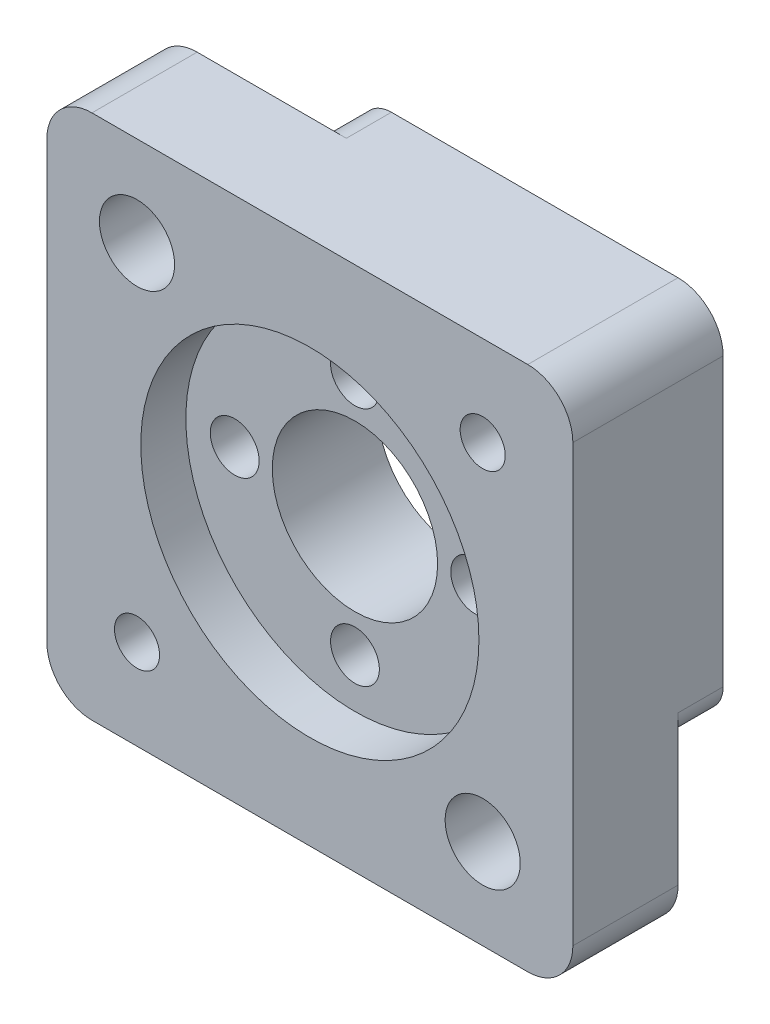
ISO-10303-21;
HEADER;
FILE_DESCRIPTION(('STEP AP214'),'2;1');
FILE_NAME('part.step','',(''),(''),'','','');
FILE_SCHEMA(('AUTOMOTIVE_DESIGN { 1 0 10303 214 1 1 1 1 }'));
ENDSEC;
DATA;
#1=APPLICATION_CONTEXT('core data for automotive mechanical design processes');
#2=APPLICATION_PROTOCOL_DEFINITION('international standard','automotive_design',2000,#1);
#3=PRODUCT_CONTEXT('',#1,'mechanical');
#4=PRODUCT('Part','Part','',(#3));
#5=PRODUCT_RELATED_PRODUCT_CATEGORY('part','',(#4));
#6=PRODUCT_DEFINITION_FORMATION('','',#4);
#7=PRODUCT_DEFINITION_CONTEXT('part definition',#1,'design');
#8=PRODUCT_DEFINITION('design','',#6,#7);
#9=PRODUCT_DEFINITION_SHAPE('','',#8);
#10=(LENGTH_UNIT() NAMED_UNIT(*) SI_UNIT(.MILLI.,.METRE.));
#11=(NAMED_UNIT(*) PLANE_ANGLE_UNIT() SI_UNIT($,.RADIAN.));
#12=(NAMED_UNIT(*) SI_UNIT($,.STERADIAN.) SOLID_ANGLE_UNIT());
#13=UNCERTAINTY_MEASURE_WITH_UNIT(LENGTH_MEASURE(1.E-05),#10,'distance_accuracy_value','');
#14=(GEOMETRIC_REPRESENTATION_CONTEXT(3) GLOBAL_UNCERTAINTY_ASSIGNED_CONTEXT((#13)) GLOBAL_UNIT_ASSIGNED_CONTEXT((#10,
#11,#12)) REPRESENTATION_CONTEXT('',''));
#15=CARTESIAN_POINT('',(0.,0.,0.));
#16=DIRECTION('',(0.,0.,1.));
#17=DIRECTION('',(1.,0.,0.));
#18=AXIS2_PLACEMENT_3D('',#15,#16,#17);
#19=CARTESIAN_POINT('',(0.,0.,0.));
#20=DIRECTION('',(0.,0.,-1.));
#21=DIRECTION('',(-1.,0.,0.));
#22=AXIS2_PLACEMENT_3D('',#19,#20,#21);
#23=PLANE('',#22);
#24=CARTESIAN_POINT('',(-11.5,11.5,0.));
#25=DIRECTION('',(0.,0.,-1.));
#26=DIRECTION('',(-1.,0.,0.));
#27=AXIS2_PLACEMENT_3D('',#24,#25,#26);
#28=CIRCLE('',#27,6.);
#29=CARTESIAN_POINT('',(-6.30384757729338,14.5,0.));
#30=VERTEX_POINT('',#29);
#31=CARTESIAN_POINT('',(-14.5,6.30384757729337,0.));
#32=VERTEX_POINT('',#31);
#33=EDGE_CURVE('E362',#30,#32,#28,.T.);
#34=ORIENTED_EDGE('',*,*,#33,.F.);
#35=CARTESIAN_POINT('',(-4.5717967697245,15.5,0.));
#36=DIRECTION('',(0.,0.,-1.));
#37=DIRECTION('',(-1.,0.,0.));
#38=AXIS2_PLACEMENT_3D('',#35,#36,#37);
#39=CIRCLE('',#38,2.);
#40=CARTESIAN_POINT('',(-4.5717967697245,17.5,0.));
#41=VERTEX_POINT('',#40);
#42=EDGE_CURVE('E229',#30,#41,#39,.T.);
#43=ORIENTED_EDGE('',*,*,#42,.T.);
#44=DIRECTION('',(-1.,0.,0.));
#45=VECTOR('',#44,1.);
#46=CARTESIAN_POINT('',(-17.5,17.5,0.));
#47=LINE('',#46,#45);
#48=CARTESIAN_POINT('',(14.5,17.5,0.));
#49=VERTEX_POINT('',#48);
#50=EDGE_CURVE('E291',#49,#41,#47,.T.);
#51=ORIENTED_EDGE('',*,*,#50,.F.);
#52=CARTESIAN_POINT('',(14.5,14.5,0.));
#53=DIRECTION('',(0.,0.,-1.));
#54=DIRECTION('',(-1.,0.,0.));
#55=AXIS2_PLACEMENT_3D('',#52,#53,#54);
#56=CIRCLE('',#55,3.);
#57=CARTESIAN_POINT('',(17.5,14.5,0.));
#58=VERTEX_POINT('',#57);
#59=EDGE_CURVE('E182',#49,#58,#56,.T.);
#60=ORIENTED_EDGE('',*,*,#59,.T.);
#61=DIRECTION('',(0.,1.,0.));
#62=VECTOR('',#61,1.);
#63=CARTESIAN_POINT('',(17.5,-17.5,0.));
#64=LINE('',#63,#62);
#65=CARTESIAN_POINT('',(17.5,-4.57179676972449,0.));
#66=VERTEX_POINT('',#65);
#67=EDGE_CURVE('E309',#66,#58,#64,.T.);
#68=ORIENTED_EDGE('',*,*,#67,.F.);
#69=CARTESIAN_POINT('',(15.5,-4.57179676972449,0.));
#70=DIRECTION('',(0.,0.,-1.));
#71=DIRECTION('',(-1.,0.,0.));
#72=AXIS2_PLACEMENT_3D('',#69,#70,#71);
#73=CIRCLE('',#72,2.);
#74=CARTESIAN_POINT('',(14.5,-6.30384757729337,0.));
#75=VERTEX_POINT('',#74);
#76=EDGE_CURVE('E220',#66,#75,#73,.T.);
#77=ORIENTED_EDGE('',*,*,#76,.T.);
#78=CARTESIAN_POINT('',(11.5,-11.5,0.));
#79=DIRECTION('',(0.,0.,-1.));
#80=DIRECTION('',(-1.,0.,0.));
#81=AXIS2_PLACEMENT_3D('',#78,#79,#80);
#82=CIRCLE('',#81,6.);
#83=CARTESIAN_POINT('',(6.30384757729338,-14.5,0.));
#84=VERTEX_POINT('',#83);
#85=EDGE_CURVE('E280',#84,#75,#82,.T.);
#86=ORIENTED_EDGE('',*,*,#85,.F.);
#87=CARTESIAN_POINT('',(4.5717967697245,-15.5,0.));
#88=DIRECTION('',(0.,0.,-1.));
#89=DIRECTION('',(-1.,0.,0.));
#90=AXIS2_PLACEMENT_3D('',#87,#88,#89);
#91=CIRCLE('',#90,2.);
#92=CARTESIAN_POINT('',(4.5717967697245,-17.5,0.));
#93=VERTEX_POINT('',#92);
#94=EDGE_CURVE('E223',#84,#93,#91,.T.);
#95=ORIENTED_EDGE('',*,*,#94,.T.);
#96=DIRECTION('',(1.,0.,0.));
#97=VECTOR('',#96,1.);
#98=CARTESIAN_POINT('',(-17.5,-17.5,0.));
#99=LINE('',#98,#97);
#100=CARTESIAN_POINT('',(-14.5,-17.5,0.));
#101=VERTEX_POINT('',#100);
#102=EDGE_CURVE('E279',#101,#93,#99,.T.);
#103=ORIENTED_EDGE('',*,*,#102,.F.);
#104=CARTESIAN_POINT('',(-14.5,-14.5,0.));
#105=DIRECTION('',(0.,0.,-1.));
#106=DIRECTION('',(-1.,0.,0.));
#107=AXIS2_PLACEMENT_3D('',#104,#105,#106);
#108=CIRCLE('',#107,3.);
#109=CARTESIAN_POINT('',(-17.5,-14.5,0.));
#110=VERTEX_POINT('',#109);
#111=EDGE_CURVE('E302',#101,#110,#108,.T.);
#112=ORIENTED_EDGE('',*,*,#111,.T.);
#113=DIRECTION('',(0.,-1.,0.));
#114=VECTOR('',#113,1.);
#115=CARTESIAN_POINT('',(-17.5,-17.5,0.));
#116=LINE('',#115,#114);
#117=CARTESIAN_POINT('',(-17.5,4.57179676972449,0.));
#118=VERTEX_POINT('',#117);
#119=EDGE_CURVE('E284',#118,#110,#116,.T.);
#120=ORIENTED_EDGE('',*,*,#119,.F.);
#121=CARTESIAN_POINT('',(-15.5,4.57179676972449,0.));
#122=DIRECTION('',(0.,0.,-1.));
#123=DIRECTION('',(-1.,0.,0.));
#124=AXIS2_PLACEMENT_3D('',#121,#122,#123);
#125=CIRCLE('',#124,2.);
#126=EDGE_CURVE('E226',#118,#32,#125,.T.);
#127=ORIENTED_EDGE('',*,*,#126,.T.);
#128=EDGE_LOOP('',(#34,#43,#51,#60,#68,#77,#86,#95,#103,#112,#120,#127));
#129=FACE_BOUND('',#128,.T.);
#130=CARTESIAN_POINT('',(-11.5,-11.5,0.));
#131=DIRECTION('',(0.,0.,1.));
#132=DIRECTION('',(1.,0.,0.));
#133=AXIS2_PLACEMENT_3D('',#130,#131,#132);
#134=CIRCLE('',#133,1.5);
#135=CARTESIAN_POINT('',(-10.,-11.5,0.));
#136=VERTEX_POINT('',#135);
#137=EDGE_CURVE('E398',#136,#136,#134,.T.);
#138=ORIENTED_EDGE('',*,*,#137,.T.);
#139=EDGE_LOOP('',(#138));
#140=FACE_BOUND('',#139,.T.);
#141=CARTESIAN_POINT('',(11.5,11.5,0.));
#142=DIRECTION('',(0.,0.,1.));
#143=DIRECTION('',(1.,0.,0.));
#144=AXIS2_PLACEMENT_3D('',#141,#142,#143);
#145=CIRCLE('',#144,1.5);
#146=CARTESIAN_POINT('',(13.,11.5,0.));
#147=VERTEX_POINT('',#146);
#148=EDGE_CURVE('E421',#147,#147,#145,.T.);
#149=ORIENTED_EDGE('',*,*,#148,.T.);
#150=EDGE_LOOP('',(#149));
#151=FACE_BOUND('',#150,.T.);
#152=CARTESIAN_POINT('',(0.,0.,0.));
#153=DIRECTION('',(0.,0.,1.));
#154=DIRECTION('',(1.,0.,0.));
#155=AXIS2_PLACEMENT_3D('',#152,#153,#154);
#156=CIRCLE('',#155,5.5);
#157=CARTESIAN_POINT('',(5.5,0.,0.));
#158=VERTEX_POINT('',#157);
#159=EDGE_CURVE('E332',#158,#158,#156,.T.);
#160=ORIENTED_EDGE('',*,*,#159,.T.);
#161=EDGE_LOOP('',(#160));
#162=FACE_BOUND('',#161,.T.);
#163=CARTESIAN_POINT('',(0.,-8.,0.));
#164=DIRECTION('',(0.,0.,1.));
#165=DIRECTION('',(1.,0.,0.));
#166=AXIS2_PLACEMENT_3D('',#163,#164,#165);
#167=CIRCLE('',#166,1.625);
#168=CARTESIAN_POINT('',(1.625,-8.,0.));
#169=VERTEX_POINT('',#168);
#170=EDGE_CURVE('E393',#169,#169,#167,.T.);
#171=ORIENTED_EDGE('',*,*,#170,.T.);
#172=EDGE_LOOP('',(#171));
#173=FACE_BOUND('',#172,.T.);
#174=CARTESIAN_POINT('',(8.,0.,0.));
#175=DIRECTION('',(0.,0.,1.));
#176=DIRECTION('',(1.,0.,0.));
#177=AXIS2_PLACEMENT_3D('',#174,#175,#176);
#178=CIRCLE('',#177,1.625);
#179=CARTESIAN_POINT('',(9.625,0.,0.));
#180=VERTEX_POINT('',#179);
#181=EDGE_CURVE('E403',#180,#180,#178,.T.);
#182=ORIENTED_EDGE('',*,*,#181,.T.);
#183=EDGE_LOOP('',(#182));
#184=FACE_BOUND('',#183,.T.);
#185=CARTESIAN_POINT('',(0.,8.,0.));
#186=DIRECTION('',(0.,0.,1.));
#187=DIRECTION('',(1.,0.,0.));
#188=AXIS2_PLACEMENT_3D('',#185,#186,#187);
#189=CIRCLE('',#188,1.625);
#190=CARTESIAN_POINT('',(1.625,8.,0.));
#191=VERTEX_POINT('',#190);
#192=EDGE_CURVE('E399',#191,#191,#189,.T.);
#193=ORIENTED_EDGE('',*,*,#192,.T.);
#194=EDGE_LOOP('',(#193));
#195=FACE_BOUND('',#194,.T.);
#196=CARTESIAN_POINT('',(-8.,0.,0.));
#197=DIRECTION('',(0.,0.,1.));
#198=DIRECTION('',(1.,0.,0.));
#199=AXIS2_PLACEMENT_3D('',#196,#197,#198);
#200=CIRCLE('',#199,1.625);
#201=CARTESIAN_POINT('',(-6.375,0.,0.));
#202=VERTEX_POINT('',#201);
#203=EDGE_CURVE('E394',#202,#202,#200,.T.);
#204=ORIENTED_EDGE('',*,*,#203,.T.);
#205=EDGE_LOOP('',(#204));
#206=FACE_BOUND('',#205,.T.);
#207=ADVANCED_FACE('F39',(#129,#140,#151,#162,#173,#184,#195,#206),#23,.T.);
#208=CARTESIAN_POINT('',(-17.5,17.5,10.));
#209=DIRECTION('',(0.,-1.,0.));
#210=DIRECTION('',(0.,0.,-1.));
#211=AXIS2_PLACEMENT_3D('',#208,#209,#210);
#212=PLANE('',#211);
#213=ORIENTED_EDGE('',*,*,#50,.T.);
#214=DIRECTION('',(0.,0.,-1.));
#215=VECTOR('',#214,1.);
#216=CARTESIAN_POINT('',(-4.5717967697245,17.5,10.));
#217=LINE('',#216,#215);
#218=CARTESIAN_POINT('',(-4.5717967697245,17.5,3.));
#219=VERTEX_POINT('',#218);
#220=EDGE_CURVE('E232',#41,#219,#217,.F.);
#221=ORIENTED_EDGE('',*,*,#220,.T.);
#222=DIRECTION('',(1.,0.,0.));
#223=VECTOR('',#222,1.);
#224=CARTESIAN_POINT('',(0.,17.5,3.));
#225=LINE('',#224,#223);
#226=CARTESIAN_POINT('',(-14.5,17.5,3.));
#227=VERTEX_POINT('',#226);
#228=EDGE_CURVE('E348',#227,#219,#225,.T.);
#229=ORIENTED_EDGE('',*,*,#228,.F.);
#230=DIRECTION('',(0.,0.,-1.));
#231=VECTOR('',#230,1.);
#232=CARTESIAN_POINT('',(-14.5,17.5,10.));
#233=LINE('',#232,#231);
#234=CARTESIAN_POINT('',(-14.5,17.5,10.));
#235=VERTEX_POINT('',#234);
#236=EDGE_CURVE('E193',#227,#235,#233,.F.);
#237=ORIENTED_EDGE('',*,*,#236,.T.);
#238=DIRECTION('',(-1.,0.,0.));
#239=VECTOR('',#238,1.);
#240=CARTESIAN_POINT('',(-17.5,17.5,10.));
#241=LINE('',#240,#239);
#242=CARTESIAN_POINT('',(14.5,17.5,10.));
#243=VERTEX_POINT('',#242);
#244=EDGE_CURVE('E289',#243,#235,#241,.T.);
#245=ORIENTED_EDGE('',*,*,#244,.F.);
#246=DIRECTION('',(0.,0.,-1.));
#247=VECTOR('',#246,1.);
#248=CARTESIAN_POINT('',(14.5,17.5,10.));
#249=LINE('',#248,#247);
#250=EDGE_CURVE('E196',#243,#49,#249,.T.);
#251=ORIENTED_EDGE('',*,*,#250,.T.);
#252=EDGE_LOOP('',(#213,#221,#229,#237,#245,#251));
#253=FACE_BOUND('',#252,.T.);
#254=ADVANCED_FACE('F336',(#253),#212,.F.);
#255=CARTESIAN_POINT('',(-17.5,-17.5,10.));
#256=DIRECTION('',(1.,0.,0.));
#257=DIRECTION('',(0.,0.,-1.));
#258=AXIS2_PLACEMENT_3D('',#255,#256,#257);
#259=PLANE('',#258);
#260=DIRECTION('',(0.,1.,0.));
#261=VECTOR('',#260,1.);
#262=CARTESIAN_POINT('',(-17.5,0.,3.));
#263=LINE('',#262,#261);
#264=CARTESIAN_POINT('',(-17.5,4.57179676972449,3.));
#265=VERTEX_POINT('',#264);
#266=CARTESIAN_POINT('',(-17.5,14.5,3.));
#267=VERTEX_POINT('',#266);
#268=EDGE_CURVE('E354',#265,#267,#263,.T.);
#269=ORIENTED_EDGE('',*,*,#268,.F.);
#270=DIRECTION('',(0.,0.,-1.));
#271=VECTOR('',#270,1.);
#272=CARTESIAN_POINT('',(-17.5,4.57179676972449,10.));
#273=LINE('',#272,#271);
#274=EDGE_CURVE('E236',#265,#118,#273,.T.);
#275=ORIENTED_EDGE('',*,*,#274,.T.);
#276=ORIENTED_EDGE('',*,*,#119,.T.);
#277=DIRECTION('',(0.,0.,-1.));
#278=VECTOR('',#277,1.);
#279=CARTESIAN_POINT('',(-17.5,-14.5,10.));
#280=LINE('',#279,#278);
#281=CARTESIAN_POINT('',(-17.5,-14.5,10.));
#282=VERTEX_POINT('',#281);
#283=EDGE_CURVE('E204',#110,#282,#280,.F.);
#284=ORIENTED_EDGE('',*,*,#283,.T.);
#285=DIRECTION('',(0.,-1.,0.));
#286=VECTOR('',#285,1.);
#287=CARTESIAN_POINT('',(-17.5,-17.5,10.));
#288=LINE('',#287,#286);
#289=CARTESIAN_POINT('',(-17.5,14.5,10.));
#290=VERTEX_POINT('',#289);
#291=EDGE_CURVE('E325',#290,#282,#288,.T.);
#292=ORIENTED_EDGE('',*,*,#291,.F.);
#293=DIRECTION('',(0.,0.,-1.));
#294=VECTOR('',#293,1.);
#295=CARTESIAN_POINT('',(-17.5,14.5,10.));
#296=LINE('',#295,#294);
#297=EDGE_CURVE('E200',#290,#267,#296,.T.);
#298=ORIENTED_EDGE('',*,*,#297,.T.);
#299=EDGE_LOOP('',(#269,#275,#276,#284,#292,#298));
#300=FACE_BOUND('',#299,.T.);
#301=ADVANCED_FACE('F444',(#300),#259,.F.);
#302=CARTESIAN_POINT('',(-11.5,11.5,10.));
#303=DIRECTION('',(0.,0.,-1.));
#304=DIRECTION('',(-1.,0.,0.));
#305=AXIS2_PLACEMENT_3D('',#302,#303,#304);
#306=CYLINDRICAL_SURFACE('',#305,2.5);
#307=CARTESIAN_POINT('',(-11.5,11.5,10.));
#308=DIRECTION('',(0.,0.,1.));
#309=DIRECTION('',(1.,0.,0.));
#310=AXIS2_PLACEMENT_3D('',#307,#308,#309);
#311=CIRCLE('',#310,2.5);
#312=CARTESIAN_POINT('',(-9.00000000000001,11.5,10.));
#313=VERTEX_POINT('',#312);
#314=EDGE_CURVE('E426',#313,#313,#311,.T.);
#315=ORIENTED_EDGE('',*,*,#314,.T.);
#316=EDGE_LOOP('',(#315));
#317=FACE_BOUND('',#316,.T.);
#318=CARTESIAN_POINT('',(-11.5,11.5,3.));
#319=DIRECTION('',(0.,0.,-1.));
#320=DIRECTION('',(-1.,0.,0.));
#321=AXIS2_PLACEMENT_3D('',#318,#319,#320);
#322=CIRCLE('',#321,2.5);
#323=CARTESIAN_POINT('',(-14.,11.5,3.));
#324=VERTEX_POINT('',#323);
#325=EDGE_CURVE('E355',#324,#324,#322,.F.);
#326=ORIENTED_EDGE('',*,*,#325,.F.);
#327=EDGE_LOOP('',(#326));
#328=FACE_BOUND('',#327,.T.);
#329=ADVANCED_FACE('F472',(#317,#328),#306,.F.);
#330=CARTESIAN_POINT('',(11.5,-11.5,10.));
#331=DIRECTION('',(0.,0.,-1.));
#332=DIRECTION('',(-1.,0.,0.));
#333=AXIS2_PLACEMENT_3D('',#330,#331,#332);
#334=CYLINDRICAL_SURFACE('',#333,2.5);
#335=CARTESIAN_POINT('',(11.5,-11.5,10.));
#336=DIRECTION('',(0.,0.,1.));
#337=DIRECTION('',(1.,0.,0.));
#338=AXIS2_PLACEMENT_3D('',#335,#336,#337);
#339=CIRCLE('',#338,2.5);
#340=CARTESIAN_POINT('',(14.,-11.5,10.));
#341=VERTEX_POINT('',#340);
#342=EDGE_CURVE('E414',#341,#341,#339,.T.);
#343=ORIENTED_EDGE('',*,*,#342,.T.);
#344=EDGE_LOOP('',(#343));
#345=FACE_BOUND('',#344,.T.);
#346=CARTESIAN_POINT('',(11.5,-11.5,3.));
#347=DIRECTION('',(0.,0.,-1.));
#348=DIRECTION('',(-1.,0.,0.));
#349=AXIS2_PLACEMENT_3D('',#346,#347,#348);
#350=CIRCLE('',#349,2.5);
#351=CARTESIAN_POINT('',(9.00000000000002,-11.5,3.));
#352=VERTEX_POINT('',#351);
#353=EDGE_CURVE('E271',#352,#352,#350,.F.);
#354=ORIENTED_EDGE('',*,*,#353,.F.);
#355=EDGE_LOOP('',(#354));
#356=FACE_BOUND('',#355,.T.);
#357=ADVANCED_FACE('F478',(#345,#356),#334,.F.);
#358=CARTESIAN_POINT('',(14.5,-14.5,10.));
#359=DIRECTION('',(0.,0.,-1.));
#360=DIRECTION('',(-1.,0.,0.));
#361=AXIS2_PLACEMENT_3D('',#358,#359,#360);
#362=CYLINDRICAL_SURFACE('',#361,3.);
#363=DIRECTION('',(0.,0.,-1.));
#364=VECTOR('',#363,1.);
#365=CARTESIAN_POINT('',(14.5,-17.5,10.));
#366=LINE('',#365,#364);
#367=CARTESIAN_POINT('',(14.5,-17.5,3.));
#368=VERTEX_POINT('',#367);
#369=CARTESIAN_POINT('',(14.5,-17.5,10.));
#370=VERTEX_POINT('',#369);
#371=EDGE_CURVE('E162',#368,#370,#366,.F.);
#372=ORIENTED_EDGE('',*,*,#371,.F.);
#373=CARTESIAN_POINT('',(14.5,-14.5,3.));
#374=DIRECTION('',(0.,0.,-1.));
#375=DIRECTION('',(-1.,0.,0.));
#376=AXIS2_PLACEMENT_3D('',#373,#374,#375);
#377=CIRCLE('',#376,3.);
#378=CARTESIAN_POINT('',(17.5,-14.5,3.));
#379=VERTEX_POINT('',#378);
#380=EDGE_CURVE('E151',#379,#368,#377,.T.);
#381=ORIENTED_EDGE('',*,*,#380,.F.);
#382=DIRECTION('',(0.,0.,-1.));
#383=VECTOR('',#382,1.);
#384=CARTESIAN_POINT('',(17.5,-14.5,10.));
#385=LINE('',#384,#383);
#386=CARTESIAN_POINT('',(17.5,-14.5,10.));
#387=VERTEX_POINT('',#386);
#388=EDGE_CURVE('E298',#387,#379,#385,.T.);
#389=ORIENTED_EDGE('',*,*,#388,.F.);
#390=CARTESIAN_POINT('',(14.5,-14.5,10.));
#391=DIRECTION('',(0.,0.,-1.));
#392=DIRECTION('',(-1.,0.,0.));
#393=AXIS2_PLACEMENT_3D('',#390,#391,#392);
#394=CIRCLE('',#393,3.);
#395=EDGE_CURVE('E172',#370,#387,#394,.F.);
#396=ORIENTED_EDGE('',*,*,#395,.F.);
#397=EDGE_LOOP('',(#372,#381,#389,#396));
#398=FACE_BOUND('',#397,.T.);
#399=ADVANCED_FACE('F171',(#398),#362,.T.);
#400=CARTESIAN_POINT('',(-14.5,14.5,10.));
#401=DIRECTION('',(0.,0.,-1.));
#402=DIRECTION('',(-1.,0.,0.));
#403=AXIS2_PLACEMENT_3D('',#400,#401,#402);
#404=CYLINDRICAL_SURFACE('',#403,3.);
#405=ORIENTED_EDGE('',*,*,#236,.F.);
#406=CARTESIAN_POINT('',(-14.5,14.5,3.));
#407=DIRECTION('',(0.,0.,-1.));
#408=DIRECTION('',(-1.,0.,0.));
#409=AXIS2_PLACEMENT_3D('',#406,#407,#408);
#410=CIRCLE('',#409,3.);
#411=EDGE_CURVE('E359',#267,#227,#410,.T.);
#412=ORIENTED_EDGE('',*,*,#411,.F.);
#413=ORIENTED_EDGE('',*,*,#297,.F.);
#414=CARTESIAN_POINT('',(-14.5,14.5,10.));
#415=DIRECTION('',(0.,0.,-1.));
#416=DIRECTION('',(-1.,0.,0.));
#417=AXIS2_PLACEMENT_3D('',#414,#415,#416);
#418=CIRCLE('',#417,3.);
#419=EDGE_CURVE('E174',#235,#290,#418,.F.);
#420=ORIENTED_EDGE('',*,*,#419,.F.);
#421=EDGE_LOOP('',(#405,#412,#413,#420));
#422=FACE_BOUND('',#421,.T.);
#423=ADVANCED_FACE('F441',(#422),#404,.T.);
#424=CARTESIAN_POINT('',(0.,0.,10.));
#425=DIRECTION('',(0.,0.,-1.));
#426=DIRECTION('',(-1.,0.,0.));
#427=AXIS2_PLACEMENT_3D('',#424,#425,#426);
#428=CYLINDRICAL_SURFACE('',#427,5.5);
#429=ORIENTED_EDGE('',*,*,#159,.F.);
#430=EDGE_LOOP('',(#429));
#431=FACE_BOUND('',#430,.T.);
#432=CARTESIAN_POINT('',(0.,0.,7.));
#433=DIRECTION('',(0.,0.,1.));
#434=DIRECTION('',(1.,0.,0.));
#435=AXIS2_PLACEMENT_3D('',#432,#433,#434);
#436=CIRCLE('',#435,5.5);
#437=CARTESIAN_POINT('',(5.5,0.,7.));
#438=VERTEX_POINT('',#437);
#439=EDGE_CURVE('E389',#438,#438,#436,.T.);
#440=ORIENTED_EDGE('',*,*,#439,.T.);
#441=EDGE_LOOP('',(#440));
#442=FACE_BOUND('',#441,.T.);
#443=ADVANCED_FACE('F486',(#431,#442),#428,.F.);
#444=CARTESIAN_POINT('',(0.,-8.,0.));
#445=DIRECTION('',(0.,0.,1.));
#446=DIRECTION('',(1.,0.,0.));
#447=AXIS2_PLACEMENT_3D('',#444,#445,#446);
#448=CYLINDRICAL_SURFACE('',#447,1.625);
#449=ORIENTED_EDGE('',*,*,#170,.F.);
#450=EDGE_LOOP('',(#449));
#451=FACE_BOUND('',#450,.T.);
#452=CARTESIAN_POINT('',(0.,-8.,7.));
#453=DIRECTION('',(0.,0.,1.));
#454=DIRECTION('',(1.,0.,0.));
#455=AXIS2_PLACEMENT_3D('',#452,#453,#454);
#456=CIRCLE('',#455,1.625);
#457=CARTESIAN_POINT('',(1.625,-8.,7.));
#458=VERTEX_POINT('',#457);
#459=EDGE_CURVE('E385',#458,#458,#456,.F.);
#460=ORIENTED_EDGE('',*,*,#459,.F.);
#461=EDGE_LOOP('',(#460));
#462=FACE_BOUND('',#461,.T.);
#463=ADVANCED_FACE('F490',(#451,#462),#448,.F.);
#464=CARTESIAN_POINT('',(8.,0.,0.));
#465=DIRECTION('',(0.,0.,1.));
#466=DIRECTION('',(1.,0.,0.));
#467=AXIS2_PLACEMENT_3D('',#464,#465,#466);
#468=CYLINDRICAL_SURFACE('',#467,1.625);
#469=ORIENTED_EDGE('',*,*,#181,.F.);
#470=EDGE_LOOP('',(#469));
#471=FACE_BOUND('',#470,.T.);
#472=CARTESIAN_POINT('',(8.,0.,7.));
#473=DIRECTION('',(0.,0.,1.));
#474=DIRECTION('',(1.,0.,0.));
#475=AXIS2_PLACEMENT_3D('',#472,#473,#474);
#476=CIRCLE('',#475,1.625);
#477=CARTESIAN_POINT('',(9.625,0.,7.));
#478=VERTEX_POINT('',#477);
#479=EDGE_CURVE('E381',#478,#478,#476,.F.);
#480=ORIENTED_EDGE('',*,*,#479,.F.);
#481=EDGE_LOOP('',(#480));
#482=FACE_BOUND('',#481,.T.);
#483=ADVANCED_FACE('F495',(#471,#482),#468,.F.);
#484=CARTESIAN_POINT('',(0.,8.,0.));
#485=DIRECTION('',(0.,0.,1.));
#486=DIRECTION('',(1.,0.,0.));
#487=AXIS2_PLACEMENT_3D('',#484,#485,#486);
#488=CYLINDRICAL_SURFACE('',#487,1.625);
#489=ORIENTED_EDGE('',*,*,#192,.F.);
#490=EDGE_LOOP('',(#489));
#491=FACE_BOUND('',#490,.T.);
#492=CARTESIAN_POINT('',(0.,8.,7.));
#493=DIRECTION('',(0.,0.,1.));
#494=DIRECTION('',(1.,0.,0.));
#495=AXIS2_PLACEMENT_3D('',#492,#493,#494);
#496=CIRCLE('',#495,1.625);
#497=CARTESIAN_POINT('',(1.625,8.,7.));
#498=VERTEX_POINT('',#497);
#499=EDGE_CURVE('E212',#498,#498,#496,.F.);
#500=ORIENTED_EDGE('',*,*,#499,.F.);
#501=EDGE_LOOP('',(#500));
#502=FACE_BOUND('',#501,.T.);
#503=ADVANCED_FACE('F515',(#491,#502),#488,.F.);
#504=CARTESIAN_POINT('',(-8.,0.,0.));
#505=DIRECTION('',(0.,0.,1.));
#506=DIRECTION('',(1.,0.,0.));
#507=AXIS2_PLACEMENT_3D('',#504,#505,#506);
#508=CYLINDRICAL_SURFACE('',#507,1.625);
#509=ORIENTED_EDGE('',*,*,#203,.F.);
#510=EDGE_LOOP('',(#509));
#511=FACE_BOUND('',#510,.T.);
#512=CARTESIAN_POINT('',(-8.,0.,7.));
#513=DIRECTION('',(0.,0.,1.));
#514=DIRECTION('',(1.,0.,0.));
#515=AXIS2_PLACEMENT_3D('',#512,#513,#514);
#516=CIRCLE('',#515,1.625);
#517=CARTESIAN_POINT('',(-6.375,0.,7.));
#518=VERTEX_POINT('',#517);
#519=EDGE_CURVE('E208',#518,#518,#516,.F.);
#520=ORIENTED_EDGE('',*,*,#519,.F.);
#521=EDGE_LOOP('',(#520));
#522=FACE_BOUND('',#521,.T.);
#523=ADVANCED_FACE('F519',(#511,#522),#508,.F.);
#524=CARTESIAN_POINT('',(0.,0.,10.));
#525=DIRECTION('',(0.,0.,-1.));
#526=DIRECTION('',(-1.,0.,0.));
#527=AXIS2_PLACEMENT_3D('',#524,#525,#526);
#528=PLANE('',#527);
#529=CARTESIAN_POINT('',(0.,0.,10.));
#530=DIRECTION('',(0.,0.,1.));
#531=DIRECTION('',(1.,0.,0.));
#532=AXIS2_PLACEMENT_3D('',#529,#530,#531);
#533=CIRCLE('',#532,11.25);
#534=CARTESIAN_POINT('',(11.25,0.,10.));
#535=VERTEX_POINT('',#534);
#536=EDGE_CURVE('E168',#535,#535,#533,.T.);
#537=ORIENTED_EDGE('',*,*,#536,.F.);
#538=EDGE_LOOP('',(#537));
#539=FACE_BOUND('',#538,.T.);
#540=DIRECTION('',(1.,0.,0.));
#541=VECTOR('',#540,1.);
#542=CARTESIAN_POINT('',(-17.5,-17.5,10.));
#543=LINE('',#542,#541);
#544=CARTESIAN_POINT('',(-14.5,-17.5,10.));
#545=VERTEX_POINT('',#544);
#546=EDGE_CURVE('E299',#545,#370,#543,.T.);
#547=ORIENTED_EDGE('',*,*,#546,.T.);
#548=ORIENTED_EDGE('',*,*,#395,.T.);
#549=DIRECTION('',(0.,1.,0.));
#550=VECTOR('',#549,1.);
#551=CARTESIAN_POINT('',(17.5,-17.5,10.));
#552=LINE('',#551,#550);
#553=CARTESIAN_POINT('',(17.5,14.5,10.));
#554=VERTEX_POINT('',#553);
#555=EDGE_CURVE('E283',#387,#554,#552,.T.);
#556=ORIENTED_EDGE('',*,*,#555,.T.);
#557=CARTESIAN_POINT('',(14.5,14.5,10.));
#558=DIRECTION('',(0.,0.,-1.));
#559=DIRECTION('',(-1.,0.,0.));
#560=AXIS2_PLACEMENT_3D('',#557,#558,#559);
#561=CIRCLE('',#560,3.);
#562=EDGE_CURVE('E188',#554,#243,#561,.F.);
#563=ORIENTED_EDGE('',*,*,#562,.T.);
#564=ORIENTED_EDGE('',*,*,#244,.T.);
#565=ORIENTED_EDGE('',*,*,#419,.T.);
#566=ORIENTED_EDGE('',*,*,#291,.T.);
#567=CARTESIAN_POINT('',(-14.5,-14.5,10.));
#568=DIRECTION('',(0.,0.,-1.));
#569=DIRECTION('',(-1.,0.,0.));
#570=AXIS2_PLACEMENT_3D('',#567,#568,#569);
#571=CIRCLE('',#570,3.);
#572=EDGE_CURVE('E179',#282,#545,#571,.F.);
#573=ORIENTED_EDGE('',*,*,#572,.T.);
#574=EDGE_LOOP('',(#547,#548,#556,#563,#564,#565,#566,#573));
#575=FACE_BOUND('',#574,.T.);
#576=ORIENTED_EDGE('',*,*,#314,.F.);
#577=EDGE_LOOP('',(#576));
#578=FACE_BOUND('',#577,.T.);
#579=CARTESIAN_POINT('',(11.5,11.5,10.));
#580=DIRECTION('',(0.,0.,1.));
#581=DIRECTION('',(1.,0.,0.));
#582=AXIS2_PLACEMENT_3D('',#579,#580,#581);
#583=CIRCLE('',#582,1.5);
#584=CARTESIAN_POINT('',(13.,11.5,10.));
#585=VERTEX_POINT('',#584);
#586=EDGE_CURVE('E422',#585,#585,#583,.T.);
#587=ORIENTED_EDGE('',*,*,#586,.F.);
#588=EDGE_LOOP('',(#587));
#589=FACE_BOUND('',#588,.T.);
#590=ORIENTED_EDGE('',*,*,#342,.F.);
#591=EDGE_LOOP('',(#590));
#592=FACE_BOUND('',#591,.T.);
#593=CARTESIAN_POINT('',(-11.5,-11.5,10.));
#594=DIRECTION('',(0.,0.,1.));
#595=DIRECTION('',(1.,0.,0.));
#596=AXIS2_PLACEMENT_3D('',#593,#594,#595);
#597=CIRCLE('',#596,1.5);
#598=CARTESIAN_POINT('',(-10.,-11.5,10.));
#599=VERTEX_POINT('',#598);
#600=EDGE_CURVE('E410',#599,#599,#597,.T.);
#601=ORIENTED_EDGE('',*,*,#600,.F.);
#602=EDGE_LOOP('',(#601));
#603=FACE_BOUND('',#602,.T.);
#604=ADVANCED_FACE('F318',(#539,#575,#578,#589,#592,#603),#528,.F.);
#605=CARTESIAN_POINT('',(17.5,-17.5,10.));
#606=DIRECTION('',(-1.,0.,0.));
#607=DIRECTION('',(0.,-1.,0.));
#608=AXIS2_PLACEMENT_3D('',#605,#606,#607);
#609=PLANE('',#608);
#610=DIRECTION('',(0.,-1.,0.));
#611=VECTOR('',#610,1.);
#612=CARTESIAN_POINT('',(17.5,0.,3.));
#613=LINE('',#612,#611);
#614=CARTESIAN_POINT('',(17.5,-4.57179676972449,3.));
#615=VERTEX_POINT('',#614);
#616=EDGE_CURVE('E55',#615,#379,#613,.T.);
#617=ORIENTED_EDGE('',*,*,#616,.F.);
#618=DIRECTION('',(0.,0.,-1.));
#619=VECTOR('',#618,1.);
#620=CARTESIAN_POINT('',(17.5,-4.57179676972449,10.));
#621=LINE('',#620,#619);
#622=EDGE_CURVE('E249',#615,#66,#621,.T.);
#623=ORIENTED_EDGE('',*,*,#622,.T.);
#624=ORIENTED_EDGE('',*,*,#67,.T.);
#625=DIRECTION('',(0.,0.,-1.));
#626=VECTOR('',#625,1.);
#627=CARTESIAN_POINT('',(17.5,14.5,10.));
#628=LINE('',#627,#626);
#629=EDGE_CURVE('E295',#58,#554,#628,.F.);
#630=ORIENTED_EDGE('',*,*,#629,.T.);
#631=ORIENTED_EDGE('',*,*,#555,.F.);
#632=ORIENTED_EDGE('',*,*,#388,.T.);
#633=EDGE_LOOP('',(#617,#623,#624,#630,#631,#632));
#634=FACE_BOUND('',#633,.T.);
#635=ADVANCED_FACE('F316',(#634),#609,.F.);
#636=CARTESIAN_POINT('',(-17.5,-17.5,10.));
#637=DIRECTION('',(0.,1.,0.));
#638=DIRECTION('',(-1.,0.,0.));
#639=AXIS2_PLACEMENT_3D('',#636,#637,#638);
#640=PLANE('',#639);
#641=ORIENTED_EDGE('',*,*,#102,.T.);
#642=DIRECTION('',(0.,0.,-1.));
#643=VECTOR('',#642,1.);
#644=CARTESIAN_POINT('',(4.5717967697245,-17.5,10.));
#645=LINE('',#644,#643);
#646=CARTESIAN_POINT('',(4.5717967697245,-17.5,3.));
#647=VERTEX_POINT('',#646);
#648=EDGE_CURVE('E165',#93,#647,#645,.F.);
#649=ORIENTED_EDGE('',*,*,#648,.T.);
#650=DIRECTION('',(-1.,0.,0.));
#651=VECTOR('',#650,1.);
#652=CARTESIAN_POINT('',(0.,-17.5,3.));
#653=LINE('',#652,#651);
#654=EDGE_CURVE('E62',#368,#647,#653,.T.);
#655=ORIENTED_EDGE('',*,*,#654,.F.);
#656=ORIENTED_EDGE('',*,*,#371,.T.);
#657=ORIENTED_EDGE('',*,*,#546,.F.);
#658=DIRECTION('',(0.,0.,-1.));
#659=VECTOR('',#658,1.);
#660=CARTESIAN_POINT('',(-14.5,-17.5,10.));
#661=LINE('',#660,#659);
#662=EDGE_CURVE('E175',#545,#101,#661,.T.);
#663=ORIENTED_EDGE('',*,*,#662,.T.);
#664=EDGE_LOOP('',(#641,#649,#655,#656,#657,#663));
#665=FACE_BOUND('',#664,.T.);
#666=ADVANCED_FACE('F160',(#665),#640,.F.);
#667=CARTESIAN_POINT('',(11.5,11.5,10.));
#668=DIRECTION('',(0.,0.,-1.));
#669=DIRECTION('',(-1.,0.,0.));
#670=AXIS2_PLACEMENT_3D('',#667,#668,#669);
#671=CYLINDRICAL_SURFACE('',#670,1.5);
#672=ORIENTED_EDGE('',*,*,#586,.T.);
#673=EDGE_LOOP('',(#672));
#674=FACE_BOUND('',#673,.T.);
#675=ORIENTED_EDGE('',*,*,#148,.F.);
#676=EDGE_LOOP('',(#675));
#677=FACE_BOUND('',#676,.T.);
#678=ADVANCED_FACE('F470',(#674,#677),#671,.F.);
#679=CARTESIAN_POINT('',(-11.5,-11.5,10.));
#680=DIRECTION('',(0.,0.,-1.));
#681=DIRECTION('',(-1.,0.,0.));
#682=AXIS2_PLACEMENT_3D('',#679,#680,#681);
#683=CYLINDRICAL_SURFACE('',#682,1.5);
#684=ORIENTED_EDGE('',*,*,#600,.T.);
#685=EDGE_LOOP('',(#684));
#686=FACE_BOUND('',#685,.T.);
#687=ORIENTED_EDGE('',*,*,#137,.F.);
#688=EDGE_LOOP('',(#687));
#689=FACE_BOUND('',#688,.T.);
#690=ADVANCED_FACE('F481',(#686,#689),#683,.F.);
#691=CARTESIAN_POINT('',(14.5,14.5,10.));
#692=DIRECTION('',(0.,0.,-1.));
#693=DIRECTION('',(-1.,0.,0.));
#694=AXIS2_PLACEMENT_3D('',#691,#692,#693);
#695=CYLINDRICAL_SURFACE('',#694,3.);
#696=ORIENTED_EDGE('',*,*,#562,.F.);
#697=ORIENTED_EDGE('',*,*,#629,.F.);
#698=ORIENTED_EDGE('',*,*,#59,.F.);
#699=ORIENTED_EDGE('',*,*,#250,.F.);
#700=EDGE_LOOP('',(#696,#697,#698,#699));
#701=FACE_BOUND('',#700,.T.);
#702=ADVANCED_FACE('F314',(#701),#695,.T.);
#703=CARTESIAN_POINT('',(-14.5,-14.5,10.));
#704=DIRECTION('',(0.,0.,-1.));
#705=DIRECTION('',(-1.,0.,0.));
#706=AXIS2_PLACEMENT_3D('',#703,#704,#705);
#707=CYLINDRICAL_SURFACE('',#706,3.);
#708=ORIENTED_EDGE('',*,*,#572,.F.);
#709=ORIENTED_EDGE('',*,*,#283,.F.);
#710=ORIENTED_EDGE('',*,*,#111,.F.);
#711=ORIENTED_EDGE('',*,*,#662,.F.);
#712=EDGE_LOOP('',(#708,#709,#710,#711));
#713=FACE_BOUND('',#712,.T.);
#714=ADVANCED_FACE('F447',(#713),#707,.T.);
#715=CARTESIAN_POINT('',(0.,0.,7.));
#716=DIRECTION('',(0.,0.,1.));
#717=DIRECTION('',(1.,0.,0.));
#718=AXIS2_PLACEMENT_3D('',#715,#716,#717);
#719=PLANE('',#718);
#720=ORIENTED_EDGE('',*,*,#439,.F.);
#721=EDGE_LOOP('',(#720));
#722=FACE_BOUND('',#721,.T.);
#723=CARTESIAN_POINT('',(0.,0.,7.));
#724=DIRECTION('',(0.,0.,1.));
#725=DIRECTION('',(1.,0.,0.));
#726=AXIS2_PLACEMENT_3D('',#723,#724,#725);
#727=CIRCLE('',#726,11.25);
#728=CARTESIAN_POINT('',(11.25,0.,7.));
#729=VERTEX_POINT('',#728);
#730=EDGE_CURVE('E213',#729,#729,#727,.T.);
#731=ORIENTED_EDGE('',*,*,#730,.T.);
#732=EDGE_LOOP('',(#731));
#733=FACE_BOUND('',#732,.T.);
#734=ORIENTED_EDGE('',*,*,#519,.T.);
#735=EDGE_LOOP('',(#734));
#736=FACE_BOUND('',#735,.T.);
#737=ORIENTED_EDGE('',*,*,#499,.T.);
#738=EDGE_LOOP('',(#737));
#739=FACE_BOUND('',#738,.T.);
#740=ORIENTED_EDGE('',*,*,#479,.T.);
#741=EDGE_LOOP('',(#740));
#742=FACE_BOUND('',#741,.T.);
#743=ORIENTED_EDGE('',*,*,#459,.T.);
#744=EDGE_LOOP('',(#743));
#745=FACE_BOUND('',#744,.T.);
#746=ADVANCED_FACE('F484',(#722,#733,#736,#739,#742,#745),#719,.T.);
#747=CARTESIAN_POINT('',(0.,0.,7.));
#748=DIRECTION('',(0.,0.,1.));
#749=DIRECTION('',(1.,0.,0.));
#750=AXIS2_PLACEMENT_3D('',#747,#748,#749);
#751=CYLINDRICAL_SURFACE('',#750,11.25);
#752=ORIENTED_EDGE('',*,*,#730,.F.);
#753=EDGE_LOOP('',(#752));
#754=FACE_BOUND('',#753,.T.);
#755=ORIENTED_EDGE('',*,*,#536,.T.);
#756=EDGE_LOOP('',(#755));
#757=FACE_BOUND('',#756,.T.);
#758=ADVANCED_FACE('F524',(#754,#757),#751,.F.);
#759=CARTESIAN_POINT('',(-11.5,11.5,3.));
#760=DIRECTION('',(0.,0.,-1.));
#761=DIRECTION('',(-1.,0.,0.));
#762=AXIS2_PLACEMENT_3D('',#759,#760,#761);
#763=CYLINDRICAL_SURFACE('',#762,6.);
#764=CARTESIAN_POINT('',(-11.5,11.5,3.));
#765=DIRECTION('',(0.,0.,-1.));
#766=DIRECTION('',(-1.,0.,0.));
#767=AXIS2_PLACEMENT_3D('',#764,#765,#766);
#768=CIRCLE('',#767,6.);
#769=CARTESIAN_POINT('',(-6.30384757729338,14.5,3.));
#770=VERTEX_POINT('',#769);
#771=CARTESIAN_POINT('',(-14.5,6.30384757729337,3.));
#772=VERTEX_POINT('',#771);
#773=EDGE_CURVE('E346',#770,#772,#768,.T.);
#774=ORIENTED_EDGE('',*,*,#773,.F.);
#775=DIRECTION('',(0.,0.,-1.));
#776=VECTOR('',#775,1.);
#777=CARTESIAN_POINT('',(-6.30384757729338,14.5,3.));
#778=LINE('',#777,#776);
#779=EDGE_CURVE('E216',#770,#30,#778,.T.);
#780=ORIENTED_EDGE('',*,*,#779,.T.);
#781=ORIENTED_EDGE('',*,*,#33,.T.);
#782=DIRECTION('',(0.,0.,-1.));
#783=VECTOR('',#782,1.);
#784=CARTESIAN_POINT('',(-14.5,6.30384757729337,3.));
#785=LINE('',#784,#783);
#786=EDGE_CURVE('E207',#32,#772,#785,.F.);
#787=ORIENTED_EDGE('',*,*,#786,.T.);
#788=EDGE_LOOP('',(#774,#780,#781,#787));
#789=FACE_BOUND('',#788,.T.);
#790=ADVANCED_FACE('F350',(#789),#763,.F.);
#791=CARTESIAN_POINT('',(0.,0.,3.));
#792=DIRECTION('',(0.,0.,-1.));
#793=DIRECTION('',(-1.,0.,0.));
#794=AXIS2_PLACEMENT_3D('',#791,#792,#793);
#795=PLANE('',#794);
#796=ORIENTED_EDGE('',*,*,#325,.T.);
#797=EDGE_LOOP('',(#796));
#798=FACE_BOUND('',#797,.T.);
#799=ORIENTED_EDGE('',*,*,#228,.T.);
#800=CARTESIAN_POINT('',(-4.5717967697245,15.5,3.));
#801=DIRECTION('',(0.,0.,-1.));
#802=DIRECTION('',(-1.,0.,0.));
#803=AXIS2_PLACEMENT_3D('',#800,#801,#802);
#804=CIRCLE('',#803,2.);
#805=EDGE_CURVE('E252',#219,#770,#804,.F.);
#806=ORIENTED_EDGE('',*,*,#805,.T.);
#807=ORIENTED_EDGE('',*,*,#773,.T.);
#808=CARTESIAN_POINT('',(-15.5,4.57179676972449,3.));
#809=DIRECTION('',(0.,0.,-1.));
#810=DIRECTION('',(-1.,0.,0.));
#811=AXIS2_PLACEMENT_3D('',#808,#809,#810);
#812=CIRCLE('',#811,2.);
#813=EDGE_CURVE('E255',#772,#265,#812,.F.);
#814=ORIENTED_EDGE('',*,*,#813,.T.);
#815=ORIENTED_EDGE('',*,*,#268,.T.);
#816=ORIENTED_EDGE('',*,*,#411,.T.);
#817=EDGE_LOOP('',(#799,#806,#807,#814,#815,#816));
#818=FACE_BOUND('',#817,.T.);
#819=ADVANCED_FACE('F345',(#798,#818),#795,.T.);
#820=CARTESIAN_POINT('',(11.5,-11.5,3.));
#821=DIRECTION('',(0.,0.,-1.));
#822=DIRECTION('',(-1.,0.,0.));
#823=AXIS2_PLACEMENT_3D('',#820,#821,#822);
#824=CYLINDRICAL_SURFACE('',#823,6.);
#825=CARTESIAN_POINT('',(11.5,-11.5,3.));
#826=DIRECTION('',(0.,0.,-1.));
#827=DIRECTION('',(-1.,0.,0.));
#828=AXIS2_PLACEMENT_3D('',#825,#826,#827);
#829=CIRCLE('',#828,6.);
#830=CARTESIAN_POINT('',(6.30384757729338,-14.5,3.));
#831=VERTEX_POINT('',#830);
#832=CARTESIAN_POINT('',(14.5,-6.30384757729337,3.));
#833=VERTEX_POINT('',#832);
#834=EDGE_CURVE('E261',#831,#833,#829,.T.);
#835=ORIENTED_EDGE('',*,*,#834,.F.);
#836=DIRECTION('',(0.,0.,-1.));
#837=VECTOR('',#836,1.);
#838=CARTESIAN_POINT('',(6.30384757729338,-14.5,3.));
#839=LINE('',#838,#837);
#840=EDGE_CURVE('E243',#831,#84,#839,.T.);
#841=ORIENTED_EDGE('',*,*,#840,.T.);
#842=ORIENTED_EDGE('',*,*,#85,.T.);
#843=DIRECTION('',(0.,0.,-1.));
#844=VECTOR('',#843,1.);
#845=CARTESIAN_POINT('',(14.5,-6.30384757729337,3.));
#846=LINE('',#845,#844);
#847=EDGE_CURVE('E240',#75,#833,#846,.F.);
#848=ORIENTED_EDGE('',*,*,#847,.T.);
#849=EDGE_LOOP('',(#835,#841,#842,#848));
#850=FACE_BOUND('',#849,.T.);
#851=ADVANCED_FACE('F266',(#850),#824,.F.);
#852=CARTESIAN_POINT('',(0.,0.,3.));
#853=DIRECTION('',(0.,0.,-1.));
#854=DIRECTION('',(-1.,0.,0.));
#855=AXIS2_PLACEMENT_3D('',#852,#853,#854);
#856=PLANE('',#855);
#857=ORIENTED_EDGE('',*,*,#353,.T.);
#858=EDGE_LOOP('',(#857));
#859=FACE_BOUND('',#858,.T.);
#860=ORIENTED_EDGE('',*,*,#654,.T.);
#861=CARTESIAN_POINT('',(4.5717967697245,-15.5,3.));
#862=DIRECTION('',(0.,0.,-1.));
#863=DIRECTION('',(-1.,0.,0.));
#864=AXIS2_PLACEMENT_3D('',#861,#862,#863);
#865=CIRCLE('',#864,2.);
#866=EDGE_CURVE('E48',#647,#831,#865,.F.);
#867=ORIENTED_EDGE('',*,*,#866,.T.);
#868=ORIENTED_EDGE('',*,*,#834,.T.);
#869=CARTESIAN_POINT('',(15.5,-4.57179676972449,3.));
#870=DIRECTION('',(0.,0.,-1.));
#871=DIRECTION('',(-1.,0.,0.));
#872=AXIS2_PLACEMENT_3D('',#869,#870,#871);
#873=CIRCLE('',#872,2.);
#874=EDGE_CURVE('E11',#833,#615,#873,.F.);
#875=ORIENTED_EDGE('',*,*,#874,.T.);
#876=ORIENTED_EDGE('',*,*,#616,.T.);
#877=ORIENTED_EDGE('',*,*,#380,.T.);
#878=EDGE_LOOP('',(#860,#867,#868,#875,#876,#877));
#879=FACE_BOUND('',#878,.T.);
#880=ADVANCED_FACE('F152',(#859,#879),#856,.T.);
#881=CARTESIAN_POINT('',(-4.5717967697245,15.5,3.));
#882=DIRECTION('',(0.,0.,-1.));
#883=DIRECTION('',(-1.,0.,0.));
#884=AXIS2_PLACEMENT_3D('',#881,#882,#883);
#885=CYLINDRICAL_SURFACE('',#884,2.);
#886=ORIENTED_EDGE('',*,*,#805,.F.);
#887=ORIENTED_EDGE('',*,*,#220,.F.);
#888=ORIENTED_EDGE('',*,*,#42,.F.);
#889=ORIENTED_EDGE('',*,*,#779,.F.);
#890=EDGE_LOOP('',(#886,#887,#888,#889));
#891=FACE_BOUND('',#890,.T.);
#892=ADVANCED_FACE('F340',(#891),#885,.T.);
#893=CARTESIAN_POINT('',(-15.5,4.57179676972449,3.));
#894=DIRECTION('',(0.,0.,-1.));
#895=DIRECTION('',(-1.,0.,0.));
#896=AXIS2_PLACEMENT_3D('',#893,#894,#895);
#897=CYLINDRICAL_SURFACE('',#896,2.);
#898=ORIENTED_EDGE('',*,*,#813,.F.);
#899=ORIENTED_EDGE('',*,*,#786,.F.);
#900=ORIENTED_EDGE('',*,*,#126,.F.);
#901=ORIENTED_EDGE('',*,*,#274,.F.);
#902=EDGE_LOOP('',(#898,#899,#900,#901));
#903=FACE_BOUND('',#902,.T.);
#904=ADVANCED_FACE('F451',(#903),#897,.T.);
#905=CARTESIAN_POINT('',(4.5717967697245,-15.5,3.));
#906=DIRECTION('',(0.,0.,-1.));
#907=DIRECTION('',(-1.,0.,0.));
#908=AXIS2_PLACEMENT_3D('',#905,#906,#907);
#909=CYLINDRICAL_SURFACE('',#908,2.);
#910=ORIENTED_EDGE('',*,*,#866,.F.);
#911=ORIENTED_EDGE('',*,*,#648,.F.);
#912=ORIENTED_EDGE('',*,*,#94,.F.);
#913=ORIENTED_EDGE('',*,*,#840,.F.);
#914=EDGE_LOOP('',(#910,#911,#912,#913));
#915=FACE_BOUND('',#914,.T.);
#916=ADVANCED_FACE('F273',(#915),#909,.T.);
#917=CARTESIAN_POINT('',(15.5,-4.57179676972449,3.));
#918=DIRECTION('',(0.,0.,-1.));
#919=DIRECTION('',(-1.,0.,0.));
#920=AXIS2_PLACEMENT_3D('',#917,#918,#919);
#921=CYLINDRICAL_SURFACE('',#920,2.);
#922=ORIENTED_EDGE('',*,*,#874,.F.);
#923=ORIENTED_EDGE('',*,*,#847,.F.);
#924=ORIENTED_EDGE('',*,*,#76,.F.);
#925=ORIENTED_EDGE('',*,*,#622,.F.);
#926=EDGE_LOOP('',(#922,#923,#924,#925));
#927=FACE_BOUND('',#926,.T.);
#928=ADVANCED_FACE('F41',(#927),#921,.T.);
#929=CLOSED_SHELL('',(#207,#254,#301,#329,#357,#399,#423,#443,#463,#483,#503,#523,#604,#635,
#666,#678,#690,#702,#714,#746,#758,#790,#819,#851,#880,#892,#904,#916,#928));
#930=MANIFOLD_SOLID_BREP('B2',#929);
#931=ADVANCED_BREP_SHAPE_REPRESENTATION('',(#18,#930),#14);
#932=SHAPE_DEFINITION_REPRESENTATION(#9,#931);
ENDSEC;
END-ISO-10303-21;
